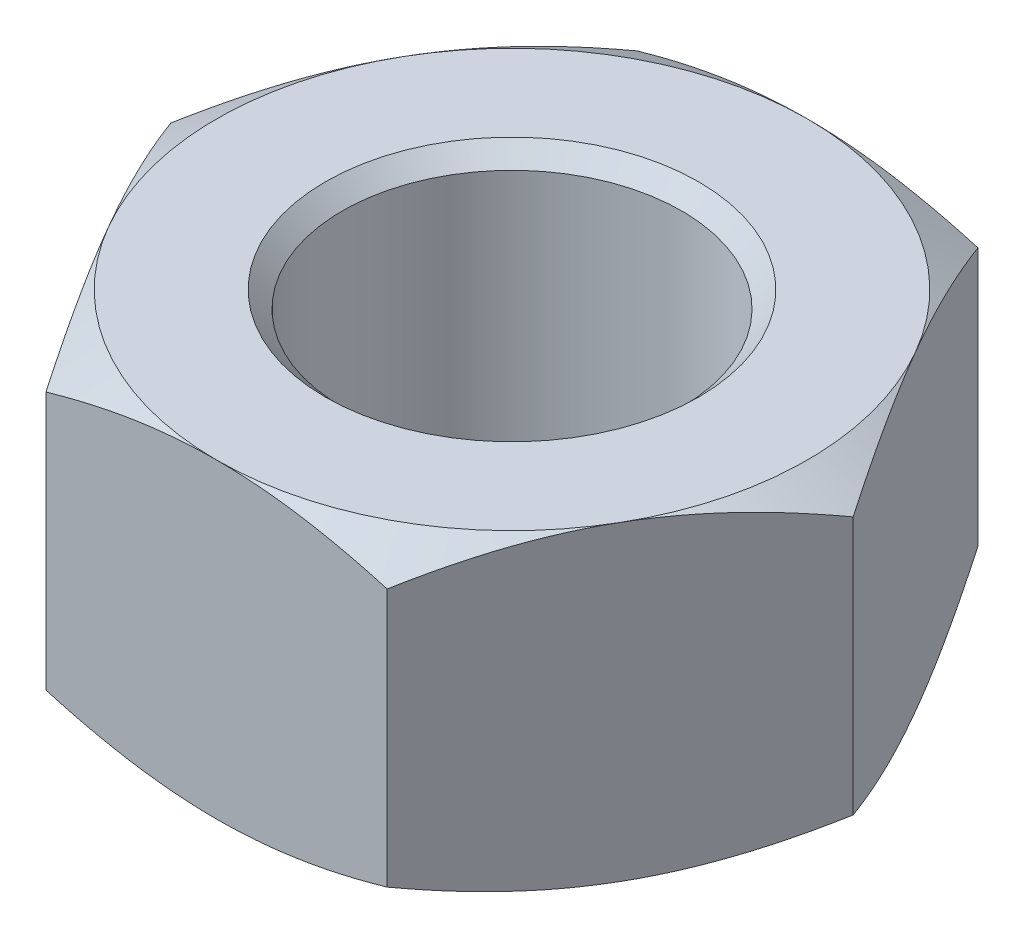
ISO-10303-21;
HEADER;
FILE_DESCRIPTION(('STEP AP214'),'2;1');
FILE_NAME('part.step','',(''),(''),'','','');
FILE_SCHEMA(('AUTOMOTIVE_DESIGN { 1 0 10303 214 1 1 1 1 }'));
ENDSEC;
DATA;
#1=APPLICATION_CONTEXT('core data for automotive mechanical design processes');
#2=APPLICATION_PROTOCOL_DEFINITION('international standard','automotive_design',2000,#1);
#3=PRODUCT_CONTEXT('',#1,'mechanical');
#4=PRODUCT('Part','Part','',(#3));
#5=PRODUCT_RELATED_PRODUCT_CATEGORY('part','',(#4));
#6=PRODUCT_DEFINITION_FORMATION('','',#4);
#7=PRODUCT_DEFINITION_CONTEXT('part definition',#1,'design');
#8=PRODUCT_DEFINITION('design','',#6,#7);
#9=PRODUCT_DEFINITION_SHAPE('','',#8);
#10=(LENGTH_UNIT() NAMED_UNIT(*) SI_UNIT(.MILLI.,.METRE.));
#11=(NAMED_UNIT(*) PLANE_ANGLE_UNIT() SI_UNIT($,.RADIAN.));
#12=(NAMED_UNIT(*) SI_UNIT($,.STERADIAN.) SOLID_ANGLE_UNIT());
#13=UNCERTAINTY_MEASURE_WITH_UNIT(LENGTH_MEASURE(1.E-05),#10,'distance_accuracy_value','');
#14=(GEOMETRIC_REPRESENTATION_CONTEXT(3) GLOBAL_UNCERTAINTY_ASSIGNED_CONTEXT((#13)) GLOBAL_UNIT_ASSIGNED_CONTEXT((#10,
#11,#12)) REPRESENTATION_CONTEXT('',''));
#15=CARTESIAN_POINT('',(0.,0.,0.));
#16=DIRECTION('',(0.,0.,1.));
#17=DIRECTION('',(1.,0.,0.));
#18=AXIS2_PLACEMENT_3D('',#15,#16,#17);
#19=CARTESIAN_POINT('',(55.2272413359522,-69.,-4.75));
#20=DIRECTION('',(0.866025403784439,0.,-0.5));
#21=DIRECTION('',(-0.5,0.,-0.866025403784439));
#22=AXIS2_PLACEMENT_3D('',#19,#20,#21);
#23=PLANE('',#22);
#24=CARTESIAN_POINT('',(52.4819837774524,-67.1498517286183,-9.50492557118405));
#25=CARTESIAN_POINT('',(53.9533399166947,-68.,-6.95646198198795));
#26=CARTESIAN_POINT('',(55.2272413359522,-68.,-4.75));
#27=CARTESIAN_POINT('',(56.5011427552097,-68.0000000000001,-2.54353801801205));
#28=CARTESIAN_POINT('',(57.9724988944519,-67.1498517286183,0.00492557118405202));
#29=(BOUNDED_CURVE() B_SPLINE_CURVE(2,(#24,#25,#26,#27,#28),.UNSPECIFIED.,.F.,
.F.) B_SPLINE_CURVE_WITH_KNOTS((3,2,3),(0.,5.57015057763849,11.140301155277),
.UNSPECIFIED.) CURVE() GEOMETRIC_REPRESENTATION_ITEM() RATIONAL_B_SPLINE_CURVE((1.,
1.03802697460132,1.,1.03802697460132,1.)) REPRESENTATION_ITEM(''));
#30=CARTESIAN_POINT('',(52.4848275573015,-67.1514942239681,-9.5));
#31=VERTEX_POINT('',#30);
#32=CARTESIAN_POINT('',(55.2272413359522,-68.,-4.75));
#33=VERTEX_POINT('',#32);
#34=EDGE_CURVE('E165',#31,#33,#29,.T.);
#35=ORIENTED_EDGE('',*,*,#34,.F.);
#36=DIRECTION('',(0.,1.,0.));
#37=VECTOR('',#36,1.);
#38=CARTESIAN_POINT('',(52.4848275573015,-69.,-9.5));
#39=LINE('',#38,#37);
#40=CARTESIAN_POINT('',(52.4848275573015,-58.8485057760319,-9.5));
#41=VERTEX_POINT('',#40);
#42=EDGE_CURVE('E11',#31,#41,#39,.T.);
#43=ORIENTED_EDGE('',*,*,#42,.T.);
#44=CARTESIAN_POINT('',(57.9724988944519,-58.8501482713817,0.00492557118405869));
#45=CARTESIAN_POINT('',(56.5011427552096,-58.,-2.54353801801204));
#46=CARTESIAN_POINT('',(55.2272413359522,-58.,-4.75));
#47=CARTESIAN_POINT('',(53.9533399166948,-58.,-6.95646198198795));
#48=CARTESIAN_POINT('',(52.4819837774524,-58.8501482713817,-9.50492557118406));
#49=(BOUNDED_CURVE() B_SPLINE_CURVE(2,(#44,#45,#46,#47,#48),.UNSPECIFIED.,.F.,
.F.) B_SPLINE_CURVE_WITH_KNOTS((3,2,3),(0.,5.57015057763849,11.140301155277),
.UNSPECIFIED.) CURVE() GEOMETRIC_REPRESENTATION_ITEM() RATIONAL_B_SPLINE_CURVE((1.,
1.03802697460132,1.,1.03802697460132,1.)) REPRESENTATION_ITEM(''));
#50=CARTESIAN_POINT('',(55.2272413359522,-58.,-4.75));
#51=VERTEX_POINT('',#50);
#52=EDGE_CURVE('E116',#51,#41,#49,.T.);
#53=ORIENTED_EDGE('',*,*,#52,.F.);
#54=CARTESIAN_POINT('',(57.9724988944519,-58.8501482713817,0.00492557118405869));
#55=CARTESIAN_POINT('',(56.5011427552096,-58.,-2.54353801801204));
#56=CARTESIAN_POINT('',(55.2272413359522,-58.,-4.75));
#57=CARTESIAN_POINT('',(53.9533399166948,-58.,-6.95646198198795));
#58=CARTESIAN_POINT('',(52.4819837774524,-58.8501482713817,-9.50492557118406));
#59=(BOUNDED_CURVE() B_SPLINE_CURVE(2,(#54,#55,#56,#57,#58),.UNSPECIFIED.,.F.,
.F.) B_SPLINE_CURVE_WITH_KNOTS((3,2,3),(0.,5.57015057763849,11.140301155277),
.UNSPECIFIED.) CURVE() GEOMETRIC_REPRESENTATION_ITEM() RATIONAL_B_SPLINE_CURVE((1.,
1.03802697460132,1.,1.03802697460132,1.)) REPRESENTATION_ITEM(''));
#60=CARTESIAN_POINT('',(57.9696551146029,-58.8485057760319,0.));
#61=VERTEX_POINT('',#60);
#62=EDGE_CURVE('E126',#61,#51,#59,.T.);
#63=ORIENTED_EDGE('',*,*,#62,.F.);
#64=DIRECTION('',(0.,1.,0.));
#65=VECTOR('',#64,1.);
#66=CARTESIAN_POINT('',(57.9696551146029,-69.,0.));
#67=LINE('',#66,#65);
#68=CARTESIAN_POINT('',(57.9696551146029,-67.1514942239681,0.));
#69=VERTEX_POINT('',#68);
#70=EDGE_CURVE('E193',#69,#61,#67,.T.);
#71=ORIENTED_EDGE('',*,*,#70,.F.);
#72=CARTESIAN_POINT('',(52.4819837774524,-67.1498517286183,-9.50492557118405));
#73=CARTESIAN_POINT('',(53.9533399166947,-68.,-6.95646198198795));
#74=CARTESIAN_POINT('',(55.2272413359522,-68.,-4.75));
#75=CARTESIAN_POINT('',(56.5011427552097,-68.0000000000001,-2.54353801801205));
#76=CARTESIAN_POINT('',(57.9724988944519,-67.1498517286183,0.00492557118405202));
#77=(BOUNDED_CURVE() B_SPLINE_CURVE(2,(#72,#73,#74,#75,#76),.UNSPECIFIED.,.F.,
.F.) B_SPLINE_CURVE_WITH_KNOTS((3,2,3),(0.,5.57015057763849,11.140301155277),
.UNSPECIFIED.) CURVE() GEOMETRIC_REPRESENTATION_ITEM() RATIONAL_B_SPLINE_CURVE((1.,
1.03802697460132,1.,1.03802697460132,1.)) REPRESENTATION_ITEM(''));
#78=EDGE_CURVE('E217',#33,#69,#77,.T.);
#79=ORIENTED_EDGE('',*,*,#78,.F.);
#80=EDGE_LOOP('',(#35,#43,#53,#63,#71,#79));
#81=FACE_BOUND('',#80,.T.);
#82=ADVANCED_FACE('F16',(#81),#23,.T.);
#83=CARTESIAN_POINT('',(47.,-69.,-9.5));
#84=DIRECTION('',(0.,0.,-1.));
#85=DIRECTION('',(-1.,0.,0.));
#86=AXIS2_PLACEMENT_3D('',#83,#84,#85);
#87=PLANE('',#86);
#88=CARTESIAN_POINT('',(41.5094848830005,-67.1498517286183,-9.5));
#89=CARTESIAN_POINT('',(44.4521971614852,-68.0000000000001,-9.50000000000001));
#90=CARTESIAN_POINT('',(47.,-68.,-9.5));
#91=CARTESIAN_POINT('',(49.5478028385149,-68.0000000000001,-9.50000000000001));
#92=CARTESIAN_POINT('',(52.4905151169995,-67.1498517286183,-9.5));
#93=(BOUNDED_CURVE() B_SPLINE_CURVE(2,(#88,#89,#90,#91,#92),.UNSPECIFIED.,.F.,
.F.) B_SPLINE_CURVE_WITH_KNOTS((3,2,3),(0.,5.57015057763849,11.140301155277),
.UNSPECIFIED.) CURVE() GEOMETRIC_REPRESENTATION_ITEM() RATIONAL_B_SPLINE_CURVE((1.,
1.03802697460134,1.,1.03802697460134,1.)) REPRESENTATION_ITEM(''));
#94=CARTESIAN_POINT('',(41.5151724426986,-67.1514942239681,-9.5));
#95=VERTEX_POINT('',#94);
#96=CARTESIAN_POINT('',(47.,-68.,-9.5));
#97=VERTEX_POINT('',#96);
#98=EDGE_CURVE('E195',#95,#97,#93,.T.);
#99=ORIENTED_EDGE('',*,*,#98,.F.);
#100=DIRECTION('',(0.,1.,0.));
#101=VECTOR('',#100,1.);
#102=CARTESIAN_POINT('',(41.5151724426986,-69.,-9.5));
#103=LINE('',#102,#101);
#104=CARTESIAN_POINT('',(41.5151724426986,-58.8485057760319,-9.5));
#105=VERTEX_POINT('',#104);
#106=EDGE_CURVE('E26',#95,#105,#103,.T.);
#107=ORIENTED_EDGE('',*,*,#106,.T.);
#108=CARTESIAN_POINT('',(52.4905151169995,-58.8501482713817,-9.5));
#109=CARTESIAN_POINT('',(49.5478028385149,-58.,-9.50000000000001));
#110=CARTESIAN_POINT('',(47.,-58.,-9.5));
#111=CARTESIAN_POINT('',(44.4521971614851,-58.,-9.50000000000001));
#112=CARTESIAN_POINT('',(41.5094848830005,-58.8501482713817,-9.5));
#113=(BOUNDED_CURVE() B_SPLINE_CURVE(2,(#108,#109,#110,#111,#112),.UNSPECIFIED.,.F.,
.F.) B_SPLINE_CURVE_WITH_KNOTS((3,2,3),(0.,5.5701505776385,11.140301155277),
.UNSPECIFIED.) CURVE() GEOMETRIC_REPRESENTATION_ITEM() RATIONAL_B_SPLINE_CURVE((1.,
1.03802697460132,1.,1.03802697460132,1.)) REPRESENTATION_ITEM(''));
#114=CARTESIAN_POINT('',(47.,-58.,-9.5));
#115=VERTEX_POINT('',#114);
#116=EDGE_CURVE('E225',#115,#105,#113,.T.);
#117=ORIENTED_EDGE('',*,*,#116,.F.);
#118=CARTESIAN_POINT('',(52.4905151169995,-58.8501482713817,-9.5));
#119=CARTESIAN_POINT('',(49.5478028385149,-58.,-9.50000000000001));
#120=CARTESIAN_POINT('',(47.,-58.,-9.5));
#121=CARTESIAN_POINT('',(44.4521971614851,-58.,-9.50000000000001));
#122=CARTESIAN_POINT('',(41.5094848830005,-58.8501482713817,-9.5));
#123=(BOUNDED_CURVE() B_SPLINE_CURVE(2,(#118,#119,#120,#121,#122),.UNSPECIFIED.,.F.,
.F.) B_SPLINE_CURVE_WITH_KNOTS((3,2,3),(0.,5.5701505776385,11.140301155277),
.UNSPECIFIED.) CURVE() GEOMETRIC_REPRESENTATION_ITEM() RATIONAL_B_SPLINE_CURVE((1.,
1.03802697460132,1.,1.03802697460132,1.)) REPRESENTATION_ITEM(''));
#124=EDGE_CURVE('E117',#41,#115,#123,.T.);
#125=ORIENTED_EDGE('',*,*,#124,.F.);
#126=ORIENTED_EDGE('',*,*,#42,.F.);
#127=CARTESIAN_POINT('',(41.5094848830005,-67.1498517286183,-9.5));
#128=CARTESIAN_POINT('',(44.4521971614852,-68.0000000000001,-9.50000000000001));
#129=CARTESIAN_POINT('',(47.,-68.,-9.5));
#130=CARTESIAN_POINT('',(49.5478028385149,-68.0000000000001,-9.50000000000001));
#131=CARTESIAN_POINT('',(52.4905151169995,-67.1498517286183,-9.5));
#132=(BOUNDED_CURVE() B_SPLINE_CURVE(2,(#127,#128,#129,#130,#131),.UNSPECIFIED.,.F.,
.F.) B_SPLINE_CURVE_WITH_KNOTS((3,2,3),(0.,5.57015057763849,11.140301155277),
.UNSPECIFIED.) CURVE() GEOMETRIC_REPRESENTATION_ITEM() RATIONAL_B_SPLINE_CURVE((1.,
1.03802697460134,1.,1.03802697460134,1.)) REPRESENTATION_ITEM(''));
#133=EDGE_CURVE('E172',#97,#31,#132,.T.);
#134=ORIENTED_EDGE('',*,*,#133,.F.);
#135=EDGE_LOOP('',(#99,#107,#117,#125,#126,#134));
#136=FACE_BOUND('',#135,.T.);
#137=ADVANCED_FACE('F390',(#136),#87,.T.);
#138=CARTESIAN_POINT('',(38.7727586640478,-69.,-4.75));
#139=DIRECTION('',(-0.866025403784439,0.,-0.5));
#140=DIRECTION('',(-0.5,0.,0.866025403784439));
#141=AXIS2_PLACEMENT_3D('',#138,#139,#140);
#142=PLANE('',#141);
#143=CARTESIAN_POINT('',(36.0275011055481,-67.1498517286183,0.00492557118405107));
#144=CARTESIAN_POINT('',(37.4988572447905,-68.0000000000001,-2.54353801801205));
#145=CARTESIAN_POINT('',(38.7727586640478,-68.,-4.75));
#146=CARTESIAN_POINT('',(40.0466600833053,-68.,-6.95646198198796));
#147=CARTESIAN_POINT('',(41.5180162225476,-67.1498517286183,-9.50492557118406));
#148=(BOUNDED_CURVE() B_SPLINE_CURVE(2,(#143,#144,#145,#146,#147),.UNSPECIFIED.,.F.,
.F.) B_SPLINE_CURVE_WITH_KNOTS((3,2,3),(0.,5.57015057763849,11.140301155277),
.UNSPECIFIED.) CURVE() GEOMETRIC_REPRESENTATION_ITEM() RATIONAL_B_SPLINE_CURVE((1.,
1.03802697460134,1.,1.03802697460135,1.)) REPRESENTATION_ITEM(''));
#149=CARTESIAN_POINT('',(36.0303448853971,-67.1514942239681,0.));
#150=VERTEX_POINT('',#149);
#151=CARTESIAN_POINT('',(38.7727586640478,-68.,-4.75));
#152=VERTEX_POINT('',#151);
#153=EDGE_CURVE('E149',#150,#152,#148,.T.);
#154=ORIENTED_EDGE('',*,*,#153,.F.);
#155=DIRECTION('',(0.,1.,0.));
#156=VECTOR('',#155,1.);
#157=CARTESIAN_POINT('',(36.0303448853971,-69.,0.));
#158=LINE('',#157,#156);
#159=CARTESIAN_POINT('',(36.0303448853971,-58.8485057760319,0.));
#160=VERTEX_POINT('',#159);
#161=EDGE_CURVE('E194',#150,#160,#158,.T.);
#162=ORIENTED_EDGE('',*,*,#161,.T.);
#163=CARTESIAN_POINT('',(41.5180162225476,-58.8501482713817,-9.50492557118407));
#164=CARTESIAN_POINT('',(40.0466600833053,-58.,-6.95646198198798));
#165=CARTESIAN_POINT('',(38.7727586640478,-58.,-4.75));
#166=CARTESIAN_POINT('',(37.4988572447904,-58.,-2.54353801801203));
#167=CARTESIAN_POINT('',(36.0275011055481,-58.8501482713817,0.00492557118405964));
#168=(BOUNDED_CURVE() B_SPLINE_CURVE(2,(#163,#164,#165,#166,#167),.UNSPECIFIED.,.F.,
.F.) B_SPLINE_CURVE_WITH_KNOTS((3,2,3),(0.,5.5701505776385,11.140301155277),
.UNSPECIFIED.) CURVE() GEOMETRIC_REPRESENTATION_ITEM() RATIONAL_B_SPLINE_CURVE((1.,
1.03802697460132,1.,1.03802697460132,1.)) REPRESENTATION_ITEM(''));
#169=CARTESIAN_POINT('',(38.7727586640478,-58.,-4.75));
#170=VERTEX_POINT('',#169);
#171=EDGE_CURVE('E173',#170,#160,#168,.T.);
#172=ORIENTED_EDGE('',*,*,#171,.F.);
#173=CARTESIAN_POINT('',(41.5180162225476,-58.8501482713817,-9.50492557118407));
#174=CARTESIAN_POINT('',(40.0466600833053,-58.,-6.95646198198798));
#175=CARTESIAN_POINT('',(38.7727586640478,-58.,-4.75));
#176=CARTESIAN_POINT('',(37.4988572447904,-58.,-2.54353801801203));
#177=CARTESIAN_POINT('',(36.0275011055481,-58.8501482713817,0.00492557118405964));
#178=(BOUNDED_CURVE() B_SPLINE_CURVE(2,(#173,#174,#175,#176,#177),.UNSPECIFIED.,.F.,
.F.) B_SPLINE_CURVE_WITH_KNOTS((3,2,3),(0.,5.5701505776385,11.140301155277),
.UNSPECIFIED.) CURVE() GEOMETRIC_REPRESENTATION_ITEM() RATIONAL_B_SPLINE_CURVE((1.,
1.03802697460132,1.,1.03802697460132,1.)) REPRESENTATION_ITEM(''));
#179=EDGE_CURVE('E200',#105,#170,#178,.T.);
#180=ORIENTED_EDGE('',*,*,#179,.F.);
#181=ORIENTED_EDGE('',*,*,#106,.F.);
#182=CARTESIAN_POINT('',(36.0275011055481,-67.1498517286183,0.00492557118405107));
#183=CARTESIAN_POINT('',(37.4988572447905,-68.0000000000001,-2.54353801801205));
#184=CARTESIAN_POINT('',(38.7727586640478,-68.,-4.75));
#185=CARTESIAN_POINT('',(40.0466600833053,-68.,-6.95646198198796));
#186=CARTESIAN_POINT('',(41.5180162225476,-67.1498517286183,-9.50492557118406));
#187=(BOUNDED_CURVE() B_SPLINE_CURVE(2,(#182,#183,#184,#185,#186),.UNSPECIFIED.,.F.,
.F.) B_SPLINE_CURVE_WITH_KNOTS((3,2,3),(0.,5.57015057763849,11.140301155277),
.UNSPECIFIED.) CURVE() GEOMETRIC_REPRESENTATION_ITEM() RATIONAL_B_SPLINE_CURVE((1.,
1.03802697460134,1.,1.03802697460135,1.)) REPRESENTATION_ITEM(''));
#188=EDGE_CURVE('E199',#152,#95,#187,.T.);
#189=ORIENTED_EDGE('',*,*,#188,.F.);
#190=EDGE_LOOP('',(#154,#162,#172,#180,#181,#189));
#191=FACE_BOUND('',#190,.T.);
#192=ADVANCED_FACE('F396',(#191),#142,.T.);
#193=CARTESIAN_POINT('',(55.2272413359522,-69.,4.75));
#194=DIRECTION('',(0.866025403784439,0.,0.5));
#195=DIRECTION('',(0.5,0.,-0.866025403784439));
#196=AXIS2_PLACEMENT_3D('',#193,#194,#195);
#197=PLANE('',#196);
#198=CARTESIAN_POINT('',(57.9724988944519,-67.1498517286183,-0.00492557118405583));
#199=CARTESIAN_POINT('',(56.5011427552096,-68.,2.54353801801203));
#200=CARTESIAN_POINT('',(55.2272413359522,-68.,4.75));
#201=CARTESIAN_POINT('',(53.9533399166947,-67.9999999999999,6.95646198198796));
#202=CARTESIAN_POINT('',(52.4819837774524,-67.1498517286183,9.50492557118405));
#203=(BOUNDED_CURVE() B_SPLINE_CURVE(2,(#198,#199,#200,#201,#202),.UNSPECIFIED.,.F.,
.F.) B_SPLINE_CURVE_WITH_KNOTS((3,2,3),(0.,5.57015057763849,11.140301155277),
.UNSPECIFIED.) CURVE() GEOMETRIC_REPRESENTATION_ITEM() RATIONAL_B_SPLINE_CURVE((1.,
1.03802697460133,1.,1.03802697460135,1.)) REPRESENTATION_ITEM(''));
#204=CARTESIAN_POINT('',(55.2272413359522,-68.,4.75));
#205=VERTEX_POINT('',#204);
#206=CARTESIAN_POINT('',(52.4848275573015,-67.1514942239681,9.5));
#207=VERTEX_POINT('',#206);
#208=EDGE_CURVE('E239',#205,#207,#203,.T.);
#209=ORIENTED_EDGE('',*,*,#208,.F.);
#210=CARTESIAN_POINT('',(57.9724988944519,-67.1498517286183,-0.00492557118405583));
#211=CARTESIAN_POINT('',(56.5011427552096,-68.,2.54353801801203));
#212=CARTESIAN_POINT('',(55.2272413359522,-68.,4.75));
#213=CARTESIAN_POINT('',(53.9533399166947,-67.9999999999999,6.95646198198796));
#214=CARTESIAN_POINT('',(52.4819837774524,-67.1498517286183,9.50492557118405));
#215=(BOUNDED_CURVE() B_SPLINE_CURVE(2,(#210,#211,#212,#213,#214),.UNSPECIFIED.,.F.,
.F.) B_SPLINE_CURVE_WITH_KNOTS((3,2,3),(0.,5.57015057763849,11.140301155277),
.UNSPECIFIED.) CURVE() GEOMETRIC_REPRESENTATION_ITEM() RATIONAL_B_SPLINE_CURVE((1.,
1.03802697460133,1.,1.03802697460135,1.)) REPRESENTATION_ITEM(''));
#216=EDGE_CURVE('E209',#69,#205,#215,.T.);
#217=ORIENTED_EDGE('',*,*,#216,.F.);
#218=ORIENTED_EDGE('',*,*,#70,.T.);
#219=CARTESIAN_POINT('',(52.4819837774524,-58.8501482713817,9.50492557118406));
#220=CARTESIAN_POINT('',(53.9533399166947,-58.,6.95646198198797));
#221=CARTESIAN_POINT('',(55.2272413359522,-58.,4.75));
#222=CARTESIAN_POINT('',(56.5011427552096,-58.,2.54353801801203));
#223=CARTESIAN_POINT('',(57.9724988944519,-58.8501482713817,-0.00492557118406345));
#224=(BOUNDED_CURVE() B_SPLINE_CURVE(2,(#219,#220,#221,#222,#223),.UNSPECIFIED.,.F.,
.F.) B_SPLINE_CURVE_WITH_KNOTS((3,2,3),(0.,5.5701505776385,11.140301155277),
.UNSPECIFIED.) CURVE() GEOMETRIC_REPRESENTATION_ITEM() RATIONAL_B_SPLINE_CURVE((1.,
1.03802697460133,1.,1.03802697460134,1.)) REPRESENTATION_ITEM(''));
#225=CARTESIAN_POINT('',(55.2272413359522,-58.,4.75));
#226=VERTEX_POINT('',#225);
#227=EDGE_CURVE('E142',#226,#61,#224,.T.);
#228=ORIENTED_EDGE('',*,*,#227,.F.);
#229=CARTESIAN_POINT('',(52.4819837774524,-58.8501482713817,9.50492557118406));
#230=CARTESIAN_POINT('',(53.9533399166947,-58.,6.95646198198797));
#231=CARTESIAN_POINT('',(55.2272413359522,-58.,4.75));
#232=CARTESIAN_POINT('',(56.5011427552096,-58.,2.54353801801203));
#233=CARTESIAN_POINT('',(57.9724988944519,-58.8501482713817,-0.00492557118406345));
#234=(BOUNDED_CURVE() B_SPLINE_CURVE(2,(#229,#230,#231,#232,#233),.UNSPECIFIED.,.F.,
.F.) B_SPLINE_CURVE_WITH_KNOTS((3,2,3),(0.,5.5701505776385,11.140301155277),
.UNSPECIFIED.) CURVE() GEOMETRIC_REPRESENTATION_ITEM() RATIONAL_B_SPLINE_CURVE((1.,
1.03802697460133,1.,1.03802697460134,1.)) REPRESENTATION_ITEM(''));
#235=CARTESIAN_POINT('',(52.4848275573015,-58.8485057760319,9.5));
#236=VERTEX_POINT('',#235);
#237=EDGE_CURVE('E259',#236,#226,#234,.T.);
#238=ORIENTED_EDGE('',*,*,#237,.F.);
#239=DIRECTION('',(0.,1.,0.));
#240=VECTOR('',#239,1.);
#241=CARTESIAN_POINT('',(52.4848275573015,-69.,9.5));
#242=LINE('',#241,#240);
#243=EDGE_CURVE('E188',#207,#236,#242,.T.);
#244=ORIENTED_EDGE('',*,*,#243,.F.);
#245=EDGE_LOOP('',(#209,#217,#218,#228,#238,#244));
#246=FACE_BOUND('',#245,.T.);
#247=ADVANCED_FACE('F379',(#246),#197,.T.);
#248=CARTESIAN_POINT('',(47.,-69.,9.5));
#249=DIRECTION('',(0.,0.,1.));
#250=DIRECTION('',(1.,0.,0.));
#251=AXIS2_PLACEMENT_3D('',#248,#249,#250);
#252=PLANE('',#251);
#253=CARTESIAN_POINT('',(52.4905151169995,-67.1498517286183,9.5));
#254=CARTESIAN_POINT('',(49.5478028385149,-68.0000000000001,9.5));
#255=CARTESIAN_POINT('',(47.,-68.,9.5));
#256=CARTESIAN_POINT('',(44.4521971614851,-68.,9.49999999999999));
#257=CARTESIAN_POINT('',(41.5094848830005,-67.1498517286183,9.5));
#258=(BOUNDED_CURVE() B_SPLINE_CURVE(2,(#253,#254,#255,#256,#257),.UNSPECIFIED.,.F.,
.F.) B_SPLINE_CURVE_WITH_KNOTS((3,2,3),(0.,5.5701505776385,11.140301155277),
.UNSPECIFIED.) CURVE() GEOMETRIC_REPRESENTATION_ITEM() RATIONAL_B_SPLINE_CURVE((1.,
1.03802697460134,1.,1.03802697460134,1.)) REPRESENTATION_ITEM(''));
#259=CARTESIAN_POINT('',(47.,-68.,9.5));
#260=VERTEX_POINT('',#259);
#261=CARTESIAN_POINT('',(41.5151724426986,-67.1514942239681,9.5));
#262=VERTEX_POINT('',#261);
#263=EDGE_CURVE('E314',#260,#262,#258,.T.);
#264=ORIENTED_EDGE('',*,*,#263,.F.);
#265=CARTESIAN_POINT('',(52.4905151169995,-67.1498517286183,9.5));
#266=CARTESIAN_POINT('',(49.5478028385149,-68.0000000000001,9.5));
#267=CARTESIAN_POINT('',(47.,-68.,9.5));
#268=CARTESIAN_POINT('',(44.4521971614851,-68.,9.49999999999999));
#269=CARTESIAN_POINT('',(41.5094848830005,-67.1498517286183,9.5));
#270=(BOUNDED_CURVE() B_SPLINE_CURVE(2,(#265,#266,#267,#268,#269),.UNSPECIFIED.,.F.,
.F.) B_SPLINE_CURVE_WITH_KNOTS((3,2,3),(0.,5.5701505776385,11.140301155277),
.UNSPECIFIED.) CURVE() GEOMETRIC_REPRESENTATION_ITEM() RATIONAL_B_SPLINE_CURVE((1.,
1.03802697460134,1.,1.03802697460134,1.)) REPRESENTATION_ITEM(''));
#271=EDGE_CURVE('E159',#207,#260,#270,.T.);
#272=ORIENTED_EDGE('',*,*,#271,.F.);
#273=ORIENTED_EDGE('',*,*,#243,.T.);
#274=CARTESIAN_POINT('',(41.5094848830005,-58.8501482713817,9.5));
#275=CARTESIAN_POINT('',(44.4521971614851,-58.,9.5));
#276=CARTESIAN_POINT('',(47.,-58.,9.5));
#277=CARTESIAN_POINT('',(49.5478028385148,-57.9999999999999,9.5));
#278=CARTESIAN_POINT('',(52.4905151169995,-58.8501482713817,9.5));
#279=(BOUNDED_CURVE() B_SPLINE_CURVE(2,(#274,#275,#276,#277,#278),.UNSPECIFIED.,.F.,
.F.) B_SPLINE_CURVE_WITH_KNOTS((3,2,3),(0.,5.5701505776385,11.140301155277),
.UNSPECIFIED.) CURVE() GEOMETRIC_REPRESENTATION_ITEM() RATIONAL_B_SPLINE_CURVE((1.,
1.03802697460136,1.,1.03802697460136,1.)) REPRESENTATION_ITEM(''));
#280=CARTESIAN_POINT('',(47.,-58.,9.5));
#281=VERTEX_POINT('',#280);
#282=EDGE_CURVE('E279',#281,#236,#279,.T.);
#283=ORIENTED_EDGE('',*,*,#282,.F.);
#284=CARTESIAN_POINT('',(41.5094848830005,-58.8501482713817,9.5));
#285=CARTESIAN_POINT('',(44.4521971614851,-58.,9.5));
#286=CARTESIAN_POINT('',(47.,-58.,9.5));
#287=CARTESIAN_POINT('',(49.5478028385148,-57.9999999999999,9.5));
#288=CARTESIAN_POINT('',(52.4905151169995,-58.8501482713817,9.5));
#289=(BOUNDED_CURVE() B_SPLINE_CURVE(2,(#284,#285,#286,#287,#288),.UNSPECIFIED.,.F.,
.F.) B_SPLINE_CURVE_WITH_KNOTS((3,2,3),(0.,5.5701505776385,11.140301155277),
.UNSPECIFIED.) CURVE() GEOMETRIC_REPRESENTATION_ITEM() RATIONAL_B_SPLINE_CURVE((1.,
1.03802697460136,1.,1.03802697460136,1.)) REPRESENTATION_ITEM(''));
#290=CARTESIAN_POINT('',(41.5151724426986,-58.8485057760319,9.5));
#291=VERTEX_POINT('',#290);
#292=EDGE_CURVE('E157',#291,#281,#289,.T.);
#293=ORIENTED_EDGE('',*,*,#292,.F.);
#294=DIRECTION('',(0.,1.,0.));
#295=VECTOR('',#294,1.);
#296=CARTESIAN_POINT('',(41.5151724426986,-69.,9.5));
#297=LINE('',#296,#295);
#298=EDGE_CURVE('E280',#262,#291,#297,.T.);
#299=ORIENTED_EDGE('',*,*,#298,.F.);
#300=EDGE_LOOP('',(#264,#272,#273,#283,#293,#299));
#301=FACE_BOUND('',#300,.T.);
#302=ADVANCED_FACE('F18',(#301),#252,.T.);
#303=CARTESIAN_POINT('',(38.7727586640478,-69.,4.75));
#304=DIRECTION('',(-0.866025403784439,0.,0.5));
#305=DIRECTION('',(0.5,0.,0.866025403784439));
#306=AXIS2_PLACEMENT_3D('',#303,#304,#305);
#307=PLANE('',#306);
#308=CARTESIAN_POINT('',(41.5180162225476,-67.1498517286183,9.50492557118405));
#309=CARTESIAN_POINT('',(40.0466600833053,-68.,6.95646198198795));
#310=CARTESIAN_POINT('',(38.7727586640478,-68.,4.75));
#311=CARTESIAN_POINT('',(37.4988572447904,-68.,2.54353801801204));
#312=CARTESIAN_POINT('',(36.0275011055481,-67.1498517286183,-0.00492557118405964));
#313=(BOUNDED_CURVE() B_SPLINE_CURVE(2,(#308,#309,#310,#311,#312),.UNSPECIFIED.,.F.,
.F.) B_SPLINE_CURVE_WITH_KNOTS((3,2,3),(0.,5.57015057763849,11.140301155277),
.UNSPECIFIED.) CURVE() GEOMETRIC_REPRESENTATION_ITEM() RATIONAL_B_SPLINE_CURVE((1.,
1.03802697460133,1.,1.03802697460134,1.)) REPRESENTATION_ITEM(''));
#314=CARTESIAN_POINT('',(38.7727586640478,-68.,4.75));
#315=VERTEX_POINT('',#314);
#316=EDGE_CURVE('E224',#315,#150,#313,.T.);
#317=ORIENTED_EDGE('',*,*,#316,.F.);
#318=CARTESIAN_POINT('',(41.5180162225476,-67.1498517286183,9.50492557118405));
#319=CARTESIAN_POINT('',(40.0466600833053,-68.,6.95646198198795));
#320=CARTESIAN_POINT('',(38.7727586640478,-68.,4.75));
#321=CARTESIAN_POINT('',(37.4988572447904,-68.,2.54353801801204));
#322=CARTESIAN_POINT('',(36.0275011055481,-67.1498517286183,-0.00492557118405964));
#323=(BOUNDED_CURVE() B_SPLINE_CURVE(2,(#318,#319,#320,#321,#322),.UNSPECIFIED.,.F.,
.F.) B_SPLINE_CURVE_WITH_KNOTS((3,2,3),(0.,5.57015057763849,11.140301155277),
.UNSPECIFIED.) CURVE() GEOMETRIC_REPRESENTATION_ITEM() RATIONAL_B_SPLINE_CURVE((1.,
1.03802697460133,1.,1.03802697460134,1.)) REPRESENTATION_ITEM(''));
#324=EDGE_CURVE('E247',#262,#315,#323,.T.);
#325=ORIENTED_EDGE('',*,*,#324,.F.);
#326=ORIENTED_EDGE('',*,*,#298,.T.);
#327=CARTESIAN_POINT('',(36.0275011055481,-58.8501482713817,-0.00492557118406345));
#328=CARTESIAN_POINT('',(37.4988572447904,-58.,2.54353801801203));
#329=CARTESIAN_POINT('',(38.7727586640478,-58.,4.75));
#330=CARTESIAN_POINT('',(40.0466600833052,-58.,6.95646198198796));
#331=CARTESIAN_POINT('',(41.5180162225476,-58.8501482713817,9.50492557118406));
#332=(BOUNDED_CURVE() B_SPLINE_CURVE(2,(#327,#328,#329,#330,#331),.UNSPECIFIED.,.F.,
.F.) B_SPLINE_CURVE_WITH_KNOTS((3,2,3),(0.,5.57015057763849,11.140301155277),
.UNSPECIFIED.) CURVE() GEOMETRIC_REPRESENTATION_ITEM() RATIONAL_B_SPLINE_CURVE((1.,
1.03802697460132,1.,1.03802697460134,1.)) REPRESENTATION_ITEM(''));
#333=CARTESIAN_POINT('',(38.7727586640478,-58.,4.75));
#334=VERTEX_POINT('',#333);
#335=EDGE_CURVE('E156',#334,#291,#332,.T.);
#336=ORIENTED_EDGE('',*,*,#335,.F.);
#337=CARTESIAN_POINT('',(36.0275011055481,-58.8501482713817,-0.00492557118406345));
#338=CARTESIAN_POINT('',(37.4988572447904,-58.,2.54353801801203));
#339=CARTESIAN_POINT('',(38.7727586640478,-58.,4.75));
#340=CARTESIAN_POINT('',(40.0466600833052,-58.,6.95646198198796));
#341=CARTESIAN_POINT('',(41.5180162225476,-58.8501482713817,9.50492557118406));
#342=(BOUNDED_CURVE() B_SPLINE_CURVE(2,(#337,#338,#339,#340,#341),.UNSPECIFIED.,.F.,
.F.) B_SPLINE_CURVE_WITH_KNOTS((3,2,3),(0.,5.57015057763849,11.140301155277),
.UNSPECIFIED.) CURVE() GEOMETRIC_REPRESENTATION_ITEM() RATIONAL_B_SPLINE_CURVE((1.,
1.03802697460132,1.,1.03802697460134,1.)) REPRESENTATION_ITEM(''));
#343=EDGE_CURVE('E230',#160,#334,#342,.T.);
#344=ORIENTED_EDGE('',*,*,#343,.F.);
#345=ORIENTED_EDGE('',*,*,#161,.F.);
#346=EDGE_LOOP('',(#317,#325,#326,#336,#344,#345));
#347=FACE_BOUND('',#346,.T.);
#348=ADVANCED_FACE('F362',(#347),#307,.T.);
#349=CARTESIAN_POINT('',(54.75,-68.,0.));
#350=DIRECTION('',(0.,-1.,0.));
#351=DIRECTION('',(-1.,0.,0.));
#352=AXIS2_PLACEMENT_3D('',#349,#350,#351);
#353=PLANE('',#352);
#354=CARTESIAN_POINT('',(47.,-68.,0.));
#355=DIRECTION('',(0.,1.,0.));
#356=DIRECTION('',(1.,0.,0.));
#357=AXIS2_PLACEMENT_3D('',#354,#355,#356);
#358=CIRCLE('',#357,6.);
#359=CARTESIAN_POINT('',(53.,-68.,0.));
#360=VERTEX_POINT('',#359);
#361=EDGE_CURVE('E33',#360,#360,#358,.T.);
#362=ORIENTED_EDGE('',*,*,#361,.T.);
#363=EDGE_LOOP('',(#362));
#364=FACE_BOUND('',#363,.T.);
#365=CARTESIAN_POINT('',(47.,-68.,0.));
#366=DIRECTION('',(0.,1.,0.));
#367=DIRECTION('',(1.,0.,0.));
#368=AXIS2_PLACEMENT_3D('',#365,#366,#367);
#369=CIRCLE('',#368,9.5);
#370=EDGE_CURVE('E208',#205,#33,#369,.T.);
#371=ORIENTED_EDGE('',*,*,#370,.F.);
#372=CARTESIAN_POINT('',(47.,-68.,0.));
#373=DIRECTION('',(0.,1.,0.));
#374=DIRECTION('',(1.,0.,0.));
#375=AXIS2_PLACEMENT_3D('',#372,#373,#374);
#376=CIRCLE('',#375,9.5);
#377=EDGE_CURVE('E164',#260,#205,#376,.T.);
#378=ORIENTED_EDGE('',*,*,#377,.F.);
#379=CARTESIAN_POINT('',(47.,-68.,0.));
#380=DIRECTION('',(0.,1.,0.));
#381=DIRECTION('',(1.,0.,0.));
#382=AXIS2_PLACEMENT_3D('',#379,#380,#381);
#383=CIRCLE('',#382,9.5);
#384=EDGE_CURVE('E319',#315,#260,#383,.T.);
#385=ORIENTED_EDGE('',*,*,#384,.F.);
#386=CARTESIAN_POINT('',(47.,-68.,0.));
#387=DIRECTION('',(0.,1.,0.));
#388=DIRECTION('',(1.,0.,0.));
#389=AXIS2_PLACEMENT_3D('',#386,#387,#388);
#390=CIRCLE('',#389,9.5);
#391=EDGE_CURVE('E218',#152,#315,#390,.T.);
#392=ORIENTED_EDGE('',*,*,#391,.F.);
#393=CARTESIAN_POINT('',(47.,-68.,0.));
#394=DIRECTION('',(0.,1.,0.));
#395=DIRECTION('',(1.,0.,0.));
#396=AXIS2_PLACEMENT_3D('',#393,#394,#395);
#397=CIRCLE('',#396,9.5);
#398=EDGE_CURVE('E81',#97,#152,#397,.T.);
#399=ORIENTED_EDGE('',*,*,#398,.F.);
#400=CARTESIAN_POINT('',(47.,-68.,0.));
#401=DIRECTION('',(0.,1.,0.));
#402=DIRECTION('',(1.,0.,0.));
#403=AXIS2_PLACEMENT_3D('',#400,#401,#402);
#404=CIRCLE('',#403,9.5);
#405=EDGE_CURVE('E95',#33,#97,#404,.T.);
#406=ORIENTED_EDGE('',*,*,#405,.F.);
#407=EDGE_LOOP('',(#371,#378,#385,#392,#399,#406));
#408=FACE_BOUND('',#407,.T.);
#409=ADVANCED_FACE('F385',(#364,#408),#353,.T.);
#410=CARTESIAN_POINT('',(47.,-67.729375,0.));
#411=DIRECTION('',(0.,-1.,0.));
#412=DIRECTION('',(1.,0.,0.));
#413=AXIS2_PLACEMENT_3D('',#410,#411,#412);
#414=CONICAL_SURFACE('',#413,5.729375,0.785398163397448);
#415=CARTESIAN_POINT('',(47.,-67.45875,0.));
#416=DIRECTION('',(0.,1.,0.));
#417=DIRECTION('',(1.,0.,0.));
#418=AXIS2_PLACEMENT_3D('',#415,#416,#417);
#419=CIRCLE('',#418,5.45875);
#420=CARTESIAN_POINT('',(52.45875,-67.45875,0.));
#421=VERTEX_POINT('',#420);
#422=EDGE_CURVE('E313',#421,#421,#419,.T.);
#423=ORIENTED_EDGE('',*,*,#422,.T.);
#424=EDGE_LOOP('',(#423));
#425=FACE_BOUND('',#424,.T.);
#426=ORIENTED_EDGE('',*,*,#361,.F.);
#427=EDGE_LOOP('',(#426));
#428=FACE_BOUND('',#427,.T.);
#429=ADVANCED_FACE('F423',(#425,#428),#414,.F.);
#430=CARTESIAN_POINT('',(47.,-63.,0.));
#431=DIRECTION('',(0.,-1.,0.));
#432=DIRECTION('',(1.,0.,0.));
#433=AXIS2_PLACEMENT_3D('',#430,#431,#432);
#434=CYLINDRICAL_SURFACE('',#433,5.45875);
#435=CARTESIAN_POINT('',(47.,-58.54125,0.));
#436=DIRECTION('',(0.,1.,0.));
#437=DIRECTION('',(1.,0.,0.));
#438=AXIS2_PLACEMENT_3D('',#435,#436,#437);
#439=CIRCLE('',#438,5.45875);
#440=CARTESIAN_POINT('',(52.45875,-58.54125,0.));
#441=VERTEX_POINT('',#440);
#442=EDGE_CURVE('E235',#441,#441,#439,.T.);
#443=ORIENTED_EDGE('',*,*,#442,.T.);
#444=EDGE_LOOP('',(#443));
#445=FACE_BOUND('',#444,.T.);
#446=ORIENTED_EDGE('',*,*,#422,.F.);
#447=EDGE_LOOP('',(#446));
#448=FACE_BOUND('',#447,.T.);
#449=ADVANCED_FACE('F460',(#445,#448),#434,.F.);
#450=CARTESIAN_POINT('',(47.,-58.270625,0.));
#451=DIRECTION('',(0.,1.,0.));
#452=DIRECTION('',(1.,0.,0.));
#453=AXIS2_PLACEMENT_3D('',#450,#451,#452);
#454=CONICAL_SURFACE('',#453,5.729375,0.785398163397448);
#455=CARTESIAN_POINT('',(47.,-58.,0.));
#456=DIRECTION('',(0.,1.,0.));
#457=DIRECTION('',(1.,0.,0.));
#458=AXIS2_PLACEMENT_3D('',#455,#456,#457);
#459=CIRCLE('',#458,6.);
#460=CARTESIAN_POINT('',(53.,-58.,0.));
#461=VERTEX_POINT('',#460);
#462=EDGE_CURVE('E122',#461,#461,#459,.T.);
#463=ORIENTED_EDGE('',*,*,#462,.T.);
#464=EDGE_LOOP('',(#463));
#465=FACE_BOUND('',#464,.T.);
#466=ORIENTED_EDGE('',*,*,#442,.F.);
#467=EDGE_LOOP('',(#466));
#468=FACE_BOUND('',#467,.T.);
#469=ADVANCED_FACE('F446',(#465,#468),#454,.F.);
#470=CARTESIAN_POINT('',(54.75,-58.,0.));
#471=DIRECTION('',(0.,1.,0.));
#472=DIRECTION('',(1.,0.,0.));
#473=AXIS2_PLACEMENT_3D('',#470,#471,#472);
#474=PLANE('',#473);
#475=CARTESIAN_POINT('',(47.,-58.,0.));
#476=DIRECTION('',(0.,1.,0.));
#477=DIRECTION('',(1.,0.,0.));
#478=AXIS2_PLACEMENT_3D('',#475,#476,#477);
#479=CIRCLE('',#478,9.5);
#480=EDGE_CURVE('E128',#226,#51,#479,.T.);
#481=ORIENTED_EDGE('',*,*,#480,.T.);
#482=CARTESIAN_POINT('',(47.,-58.,0.));
#483=DIRECTION('',(0.,1.,0.));
#484=DIRECTION('',(1.,0.,0.));
#485=AXIS2_PLACEMENT_3D('',#482,#483,#484);
#486=CIRCLE('',#485,9.5);
#487=EDGE_CURVE('E114',#51,#115,#486,.T.);
#488=ORIENTED_EDGE('',*,*,#487,.T.);
#489=CARTESIAN_POINT('',(47.,-58.,0.));
#490=DIRECTION('',(0.,1.,0.));
#491=DIRECTION('',(1.,0.,0.));
#492=AXIS2_PLACEMENT_3D('',#489,#490,#491);
#493=CIRCLE('',#492,9.5);
#494=EDGE_CURVE('E20',#115,#170,#493,.T.);
#495=ORIENTED_EDGE('',*,*,#494,.T.);
#496=CARTESIAN_POINT('',(47.,-58.,0.));
#497=DIRECTION('',(0.,1.,0.));
#498=DIRECTION('',(1.,0.,0.));
#499=AXIS2_PLACEMENT_3D('',#496,#497,#498);
#500=CIRCLE('',#499,9.5);
#501=EDGE_CURVE('E181',#170,#334,#500,.T.);
#502=ORIENTED_EDGE('',*,*,#501,.T.);
#503=CARTESIAN_POINT('',(47.,-58.,0.));
#504=DIRECTION('',(0.,1.,0.));
#505=DIRECTION('',(1.,0.,0.));
#506=AXIS2_PLACEMENT_3D('',#503,#504,#505);
#507=CIRCLE('',#506,9.5);
#508=EDGE_CURVE('E152',#334,#281,#507,.T.);
#509=ORIENTED_EDGE('',*,*,#508,.T.);
#510=CARTESIAN_POINT('',(47.,-58.,0.));
#511=DIRECTION('',(0.,1.,0.));
#512=DIRECTION('',(1.,0.,0.));
#513=AXIS2_PLACEMENT_3D('',#510,#511,#512);
#514=CIRCLE('',#513,9.5);
#515=EDGE_CURVE('E136',#281,#226,#514,.T.);
#516=ORIENTED_EDGE('',*,*,#515,.T.);
#517=EDGE_LOOP('',(#481,#488,#495,#502,#509,#516));
#518=FACE_BOUND('',#517,.T.);
#519=ORIENTED_EDGE('',*,*,#462,.F.);
#520=EDGE_LOOP('',(#519));
#521=FACE_BOUND('',#520,.T.);
#522=ADVANCED_FACE('F132',(#518,#521),#474,.T.);
#523=CARTESIAN_POINT('',(47.,-58.4250741356909,0.));
#524=DIRECTION('',(0.,-1.,0.));
#525=DIRECTION('',(1.,0.,0.));
#526=AXIS2_PLACEMENT_3D('',#523,#524,#525);
#527=CONICAL_SURFACE('',#526,10.23625,1.0471975511966);
#528=ORIENTED_EDGE('',*,*,#52,.T.);
#529=ORIENTED_EDGE('',*,*,#124,.T.);
#530=ORIENTED_EDGE('',*,*,#487,.F.);
#531=EDGE_LOOP('',(#528,#529,#530));
#532=FACE_BOUND('',#531,.T.);
#533=ADVANCED_FACE('F115',(#532),#527,.T.);
#534=CARTESIAN_POINT('',(47.,-58.4250741356909,0.));
#535=DIRECTION('',(0.,-1.,0.));
#536=DIRECTION('',(1.,0.,0.));
#537=AXIS2_PLACEMENT_3D('',#534,#535,#536);
#538=CONICAL_SURFACE('',#537,10.23625,1.0471975511966);
#539=ORIENTED_EDGE('',*,*,#227,.T.);
#540=ORIENTED_EDGE('',*,*,#62,.T.);
#541=ORIENTED_EDGE('',*,*,#480,.F.);
#542=EDGE_LOOP('',(#539,#540,#541));
#543=FACE_BOUND('',#542,.T.);
#544=ADVANCED_FACE('F141',(#543),#538,.T.);
#545=CARTESIAN_POINT('',(47.,-58.4250741356909,0.));
#546=DIRECTION('',(0.,-1.,0.));
#547=DIRECTION('',(1.,0.,0.));
#548=AXIS2_PLACEMENT_3D('',#545,#546,#547);
#549=CONICAL_SURFACE('',#548,10.23625,1.0471975511966);
#550=ORIENTED_EDGE('',*,*,#282,.T.);
#551=ORIENTED_EDGE('',*,*,#237,.T.);
#552=ORIENTED_EDGE('',*,*,#515,.F.);
#553=EDGE_LOOP('',(#550,#551,#552));
#554=FACE_BOUND('',#553,.T.);
#555=ADVANCED_FACE('F375',(#554),#549,.T.);
#556=CARTESIAN_POINT('',(47.,-58.4250741356909,0.));
#557=DIRECTION('',(0.,-1.,0.));
#558=DIRECTION('',(1.,0.,0.));
#559=AXIS2_PLACEMENT_3D('',#556,#557,#558);
#560=CONICAL_SURFACE('',#559,10.23625,1.0471975511966);
#561=ORIENTED_EDGE('',*,*,#292,.T.);
#562=ORIENTED_EDGE('',*,*,#508,.F.);
#563=ORIENTED_EDGE('',*,*,#335,.T.);
#564=EDGE_LOOP('',(#561,#562,#563));
#565=FACE_BOUND('',#564,.T.);
#566=ADVANCED_FACE('F367',(#565),#560,.T.);
#567=CARTESIAN_POINT('',(47.,-58.4250741356909,0.));
#568=DIRECTION('',(0.,-1.,0.));
#569=DIRECTION('',(1.,0.,0.));
#570=AXIS2_PLACEMENT_3D('',#567,#568,#569);
#571=CONICAL_SURFACE('',#570,10.23625,1.0471975511966);
#572=ORIENTED_EDGE('',*,*,#343,.T.);
#573=ORIENTED_EDGE('',*,*,#501,.F.);
#574=ORIENTED_EDGE('',*,*,#171,.T.);
#575=EDGE_LOOP('',(#572,#573,#574));
#576=FACE_BOUND('',#575,.T.);
#577=ADVANCED_FACE('F359',(#576),#571,.T.);
#578=CARTESIAN_POINT('',(47.,-58.4250741356909,0.));
#579=DIRECTION('',(0.,-1.,0.));
#580=DIRECTION('',(1.,0.,0.));
#581=AXIS2_PLACEMENT_3D('',#578,#579,#580);
#582=CONICAL_SURFACE('',#581,10.23625,1.0471975511966);
#583=ORIENTED_EDGE('',*,*,#179,.T.);
#584=ORIENTED_EDGE('',*,*,#494,.F.);
#585=ORIENTED_EDGE('',*,*,#116,.T.);
#586=EDGE_LOOP('',(#583,#584,#585));
#587=FACE_BOUND('',#586,.T.);
#588=ADVANCED_FACE('F393',(#587),#582,.T.);
#589=CARTESIAN_POINT('',(47.,-67.5749258643091,0.));
#590=DIRECTION('',(0.,1.,0.));
#591=DIRECTION('',(1.,0.,0.));
#592=AXIS2_PLACEMENT_3D('',#589,#590,#591);
#593=CONICAL_SURFACE('',#592,10.23625,1.0471975511966);
#594=ORIENTED_EDGE('',*,*,#78,.T.);
#595=ORIENTED_EDGE('',*,*,#216,.T.);
#596=ORIENTED_EDGE('',*,*,#370,.T.);
#597=EDGE_LOOP('',(#594,#595,#596));
#598=FACE_BOUND('',#597,.T.);
#599=ADVANCED_FACE('F427',(#598),#593,.T.);
#600=CARTESIAN_POINT('',(47.,-67.5749258643091,0.));
#601=DIRECTION('',(0.,1.,0.));
#602=DIRECTION('',(1.,0.,0.));
#603=AXIS2_PLACEMENT_3D('',#600,#601,#602);
#604=CONICAL_SURFACE('',#603,10.23625,1.0471975511966);
#605=ORIENTED_EDGE('',*,*,#133,.T.);
#606=ORIENTED_EDGE('',*,*,#34,.T.);
#607=ORIENTED_EDGE('',*,*,#405,.T.);
#608=EDGE_LOOP('',(#605,#606,#607));
#609=FACE_BOUND('',#608,.T.);
#610=ADVANCED_FACE('F388',(#609),#604,.T.);
#611=CARTESIAN_POINT('',(47.,-67.5749258643091,0.));
#612=DIRECTION('',(0.,1.,0.));
#613=DIRECTION('',(1.,0.,0.));
#614=AXIS2_PLACEMENT_3D('',#611,#612,#613);
#615=CONICAL_SURFACE('',#614,10.23625,1.0471975511966);
#616=ORIENTED_EDGE('',*,*,#188,.T.);
#617=ORIENTED_EDGE('',*,*,#98,.T.);
#618=ORIENTED_EDGE('',*,*,#398,.T.);
#619=EDGE_LOOP('',(#616,#617,#618));
#620=FACE_BOUND('',#619,.T.);
#621=ADVANCED_FACE('F432',(#620),#615,.T.);
#622=CARTESIAN_POINT('',(47.,-67.5749258643091,0.));
#623=DIRECTION('',(0.,1.,0.));
#624=DIRECTION('',(1.,0.,0.));
#625=AXIS2_PLACEMENT_3D('',#622,#623,#624);
#626=CONICAL_SURFACE('',#625,10.23625,1.0471975511966);
#627=ORIENTED_EDGE('',*,*,#153,.T.);
#628=ORIENTED_EDGE('',*,*,#391,.T.);
#629=ORIENTED_EDGE('',*,*,#316,.T.);
#630=EDGE_LOOP('',(#627,#628,#629));
#631=FACE_BOUND('',#630,.T.);
#632=ADVANCED_FACE('F411',(#631),#626,.T.);
#633=CARTESIAN_POINT('',(47.,-67.5749258643091,0.));
#634=DIRECTION('',(0.,1.,0.));
#635=DIRECTION('',(1.,0.,0.));
#636=AXIS2_PLACEMENT_3D('',#633,#634,#635);
#637=CONICAL_SURFACE('',#636,10.23625,1.0471975511966);
#638=ORIENTED_EDGE('',*,*,#324,.T.);
#639=ORIENTED_EDGE('',*,*,#384,.T.);
#640=ORIENTED_EDGE('',*,*,#263,.T.);
#641=EDGE_LOOP('',(#638,#639,#640));
#642=FACE_BOUND('',#641,.T.);
#643=ADVANCED_FACE('F402',(#642),#637,.T.);
#644=CARTESIAN_POINT('',(47.,-67.5749258643091,0.));
#645=DIRECTION('',(0.,1.,0.));
#646=DIRECTION('',(1.,0.,0.));
#647=AXIS2_PLACEMENT_3D('',#644,#645,#646);
#648=CONICAL_SURFACE('',#647,10.23625,1.0471975511966);
#649=ORIENTED_EDGE('',*,*,#271,.T.);
#650=ORIENTED_EDGE('',*,*,#377,.T.);
#651=ORIENTED_EDGE('',*,*,#208,.T.);
#652=EDGE_LOOP('',(#649,#650,#651));
#653=FACE_BOUND('',#652,.T.);
#654=ADVANCED_FACE('F404',(#653),#648,.T.);
#655=CLOSED_SHELL('',(#82,#137,#192,#247,#302,#348,#409,#429,#449,#469,#522,#533,#544,#555,#566,
#577,#588,#599,#610,#621,#632,#643,#654));
#656=MANIFOLD_SOLID_BREP('B1',#655);
#657=ADVANCED_BREP_SHAPE_REPRESENTATION('',(#18,#656),#14);
#658=SHAPE_DEFINITION_REPRESENTATION(#9,#657);
ENDSEC;
END-ISO-10303-21;
